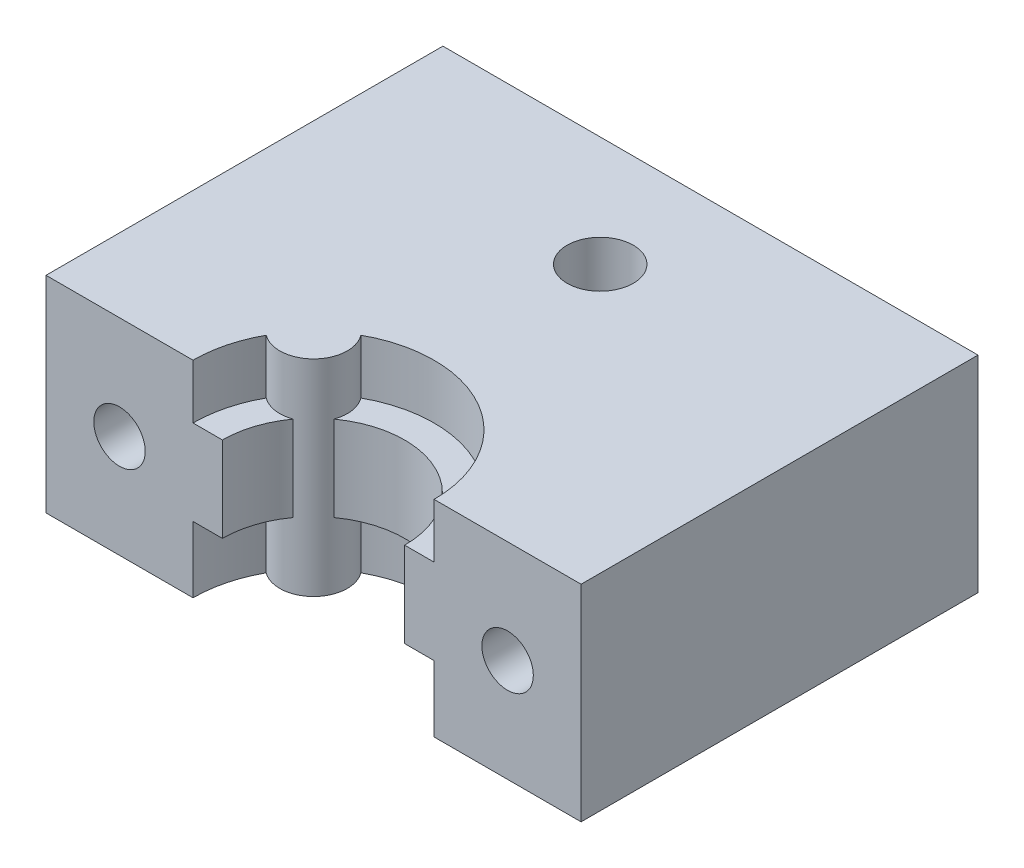
ISO-10303-21;
HEADER;
FILE_DESCRIPTION(('STEP AP214'),'2;1');
FILE_NAME('part.step','',(''),(''),'','','');
FILE_SCHEMA(('AUTOMOTIVE_DESIGN { 1 0 10303 214 1 1 1 1 }'));
ENDSEC;
DATA;
#1=APPLICATION_CONTEXT('core data for automotive mechanical design processes');
#2=APPLICATION_PROTOCOL_DEFINITION('international standard','automotive_design',2000,#1);
#3=PRODUCT_CONTEXT('',#1,'mechanical');
#4=PRODUCT('Part','Part','',(#3));
#5=PRODUCT_RELATED_PRODUCT_CATEGORY('part','',(#4));
#6=PRODUCT_DEFINITION_FORMATION('','',#4);
#7=PRODUCT_DEFINITION_CONTEXT('part definition',#1,'design');
#8=PRODUCT_DEFINITION('design','',#6,#7);
#9=PRODUCT_DEFINITION_SHAPE('','',#8);
#10=(LENGTH_UNIT() NAMED_UNIT(*) SI_UNIT(.MILLI.,.METRE.));
#11=(NAMED_UNIT(*) PLANE_ANGLE_UNIT() SI_UNIT($,.RADIAN.));
#12=(NAMED_UNIT(*) SI_UNIT($,.STERADIAN.) SOLID_ANGLE_UNIT());
#13=UNCERTAINTY_MEASURE_WITH_UNIT(LENGTH_MEASURE(1.E-05),#10,'distance_accuracy_value','');
#14=(GEOMETRIC_REPRESENTATION_CONTEXT(3) GLOBAL_UNCERTAINTY_ASSIGNED_CONTEXT((#13)) GLOBAL_UNIT_ASSIGNED_CONTEXT((#10,
#11,#12)) REPRESENTATION_CONTEXT('',''));
#15=CARTESIAN_POINT('',(0.,0.,0.));
#16=DIRECTION('',(0.,0.,1.));
#17=DIRECTION('',(1.,0.,0.));
#18=AXIS2_PLACEMENT_3D('',#15,#16,#17);
#19=CARTESIAN_POINT('',(31.4,7.,-31.9497474683059));
#20=DIRECTION('',(0.,0.,1.));
#21=DIRECTION('',(1.,0.,0.));
#22=AXIS2_PLACEMENT_3D('',#19,#20,#21);
#23=CYLINDRICAL_SURFACE('',#22,1.75000000000001);
#24=CARTESIAN_POINT('',(31.4,7.,0.));
#25=DIRECTION('',(0.,0.,1.));
#26=DIRECTION('',(1.,0.,0.));
#27=AXIS2_PLACEMENT_3D('',#24,#25,#26);
#28=CIRCLE('',#27,1.75000000000001);
#29=CARTESIAN_POINT('',(33.15,7.,0.));
#30=VERTEX_POINT('',#29);
#31=EDGE_CURVE('E279',#30,#30,#28,.T.);
#32=ORIENTED_EDGE('',*,*,#31,.T.);
#33=EDGE_LOOP('',(#32));
#34=FACE_BOUND('',#33,.T.);
#35=CARTESIAN_POINT('',(31.4,7.,-22.));
#36=DIRECTION('',(0.,0.,-1.));
#37=DIRECTION('',(-1.,0.,0.));
#38=AXIS2_PLACEMENT_3D('',#35,#36,#37);
#39=CIRCLE('',#38,1.75000000000001);
#40=CARTESIAN_POINT('',(29.65,7.,-22.));
#41=VERTEX_POINT('',#40);
#42=EDGE_CURVE('E43',#41,#41,#39,.F.);
#43=ORIENTED_EDGE('',*,*,#42,.F.);
#44=EDGE_LOOP('',(#43));
#45=FACE_BOUND('',#44,.T.);
#46=ADVANCED_FACE('F39',(#34,#45),#23,.F.);
#47=CARTESIAN_POINT('',(5.,7.,-31.9497474683059));
#48=DIRECTION('',(0.,0.,1.));
#49=DIRECTION('',(1.,0.,0.));
#50=AXIS2_PLACEMENT_3D('',#47,#48,#49);
#51=CYLINDRICAL_SURFACE('',#50,1.75);
#52=CARTESIAN_POINT('',(5.,7.,0.));
#53=DIRECTION('',(0.,0.,1.));
#54=DIRECTION('',(1.,0.,0.));
#55=AXIS2_PLACEMENT_3D('',#52,#53,#54);
#56=CIRCLE('',#55,1.75);
#57=CARTESIAN_POINT('',(6.75,7.,0.));
#58=VERTEX_POINT('',#57);
#59=EDGE_CURVE('E298',#58,#58,#56,.T.);
#60=ORIENTED_EDGE('',*,*,#59,.T.);
#61=EDGE_LOOP('',(#60));
#62=FACE_BOUND('',#61,.T.);
#63=CARTESIAN_POINT('',(5.,7.,-22.));
#64=DIRECTION('',(0.,0.,-1.));
#65=DIRECTION('',(-1.,0.,0.));
#66=AXIS2_PLACEMENT_3D('',#63,#64,#65);
#67=CIRCLE('',#66,1.75);
#68=CARTESIAN_POINT('',(3.25,7.,-22.));
#69=VERTEX_POINT('',#68);
#70=EDGE_CURVE('E273',#69,#69,#67,.F.);
#71=ORIENTED_EDGE('',*,*,#70,.F.);
#72=EDGE_LOOP('',(#71));
#73=FACE_BOUND('',#72,.T.);
#74=ADVANCED_FACE('F322',(#62,#73),#51,.F.);
#75=CARTESIAN_POINT('',(18.2,-18.3357574154983,0.));
#76=DIRECTION('',(0.,1.,0.));
#77=DIRECTION('',(-1.,0.,0.));
#78=AXIS2_PLACEMENT_3D('',#75,#76,#77);
#79=CYLINDRICAL_SURFACE('',#78,8.2);
#80=DIRECTION('',(0.,1.,0.));
#81=VECTOR('',#80,1.);
#82=CARTESIAN_POINT('',(14.2400818494279,-18.3357574154983,-7.18046295448765));
#83=LINE('',#82,#81);
#84=CARTESIAN_POINT('',(14.2400818494279,10.3,-7.18046295448765));
#85=VERTEX_POINT('',#84);
#86=CARTESIAN_POINT('',(14.2400818494279,14.,-7.18046295448765));
#87=VERTEX_POINT('',#86);
#88=EDGE_CURVE('E214',#85,#87,#83,.T.);
#89=ORIENTED_EDGE('',*,*,#88,.F.);
#90=CARTESIAN_POINT('',(18.2,10.3,0.));
#91=DIRECTION('',(0.,1.,0.));
#92=DIRECTION('',(1.,0.,0.));
#93=AXIS2_PLACEMENT_3D('',#90,#91,#92);
#94=CIRCLE('',#93,8.2);
#95=CARTESIAN_POINT('',(26.4,10.3,0.));
#96=VERTEX_POINT('',#95);
#97=EDGE_CURVE('E190',#96,#85,#94,.T.);
#98=ORIENTED_EDGE('',*,*,#97,.F.);
#99=DIRECTION('',(0.,1.,0.));
#100=VECTOR('',#99,1.);
#101=CARTESIAN_POINT('',(26.4,-18.3357574154983,0.));
#102=LINE('',#101,#100);
#103=CARTESIAN_POINT('',(26.4,14.,0.));
#104=VERTEX_POINT('',#103);
#105=EDGE_CURVE('E204',#96,#104,#102,.T.);
#106=ORIENTED_EDGE('',*,*,#105,.T.);
#107=CARTESIAN_POINT('',(18.2,14.,0.));
#108=DIRECTION('',(0.,1.,0.));
#109=DIRECTION('',(-1.,0.,0.));
#110=AXIS2_PLACEMENT_3D('',#107,#108,#109);
#111=CIRCLE('',#110,8.2);
#112=EDGE_CURVE('E201',#87,#104,#111,.F.);
#113=ORIENTED_EDGE('',*,*,#112,.F.);
#114=EDGE_LOOP('',(#89,#98,#106,#113));
#115=FACE_BOUND('',#114,.T.);
#116=ADVANCED_FACE('F315',(#115),#79,.F.);
#117=CARTESIAN_POINT('',(18.2,-18.3357574154983,0.));
#118=DIRECTION('',(0.,1.,0.));
#119=DIRECTION('',(-1.,0.,0.));
#120=AXIS2_PLACEMENT_3D('',#117,#118,#119);
#121=CYLINDRICAL_SURFACE('',#120,8.2);
#122=DIRECTION('',(0.,1.,0.));
#123=VECTOR('',#122,1.);
#124=CARTESIAN_POINT('',(10.,-18.3357574154983,0.));
#125=LINE('',#124,#123);
#126=CARTESIAN_POINT('',(9.99999999999999,10.3,0.));
#127=VERTEX_POINT('',#126);
#128=CARTESIAN_POINT('',(9.99999999999999,14.,0.));
#129=VERTEX_POINT('',#128);
#130=EDGE_CURVE('E228',#127,#129,#125,.T.);
#131=ORIENTED_EDGE('',*,*,#130,.F.);
#132=CARTESIAN_POINT('',(18.2,10.3,0.));
#133=DIRECTION('',(0.,-1.,0.));
#134=DIRECTION('',(1.,0.,0.));
#135=AXIS2_PLACEMENT_3D('',#132,#133,#134);
#136=CIRCLE('',#135,8.2);
#137=CARTESIAN_POINT('',(11.0195370455124,10.3,-3.95991815057212));
#138=VERTEX_POINT('',#137);
#139=EDGE_CURVE('E263',#127,#138,#136,.T.);
#140=ORIENTED_EDGE('',*,*,#139,.T.);
#141=DIRECTION('',(0.,1.,0.));
#142=VECTOR('',#141,1.);
#143=CARTESIAN_POINT('',(11.0195370455124,-18.3357574154983,-3.95991815057212));
#144=LINE('',#143,#142);
#145=CARTESIAN_POINT('',(11.0195370455124,14.,-3.95991815057212));
#146=VERTEX_POINT('',#145);
#147=EDGE_CURVE('E233',#138,#146,#144,.T.);
#148=ORIENTED_EDGE('',*,*,#147,.T.);
#149=CARTESIAN_POINT('',(18.2,14.,0.));
#150=DIRECTION('',(0.,1.,0.));
#151=DIRECTION('',(-1.,0.,0.));
#152=AXIS2_PLACEMENT_3D('',#149,#150,#151);
#153=CIRCLE('',#152,8.2);
#154=EDGE_CURVE('E206',#129,#146,#153,.F.);
#155=ORIENTED_EDGE('',*,*,#154,.F.);
#156=EDGE_LOOP('',(#131,#140,#148,#155));
#157=FACE_BOUND('',#156,.T.);
#158=ADVANCED_FACE('F307',(#157),#121,.F.);
#159=CARTESIAN_POINT('',(0.,0.,0.));
#160=DIRECTION('',(0.,0.,-1.));
#161=DIRECTION('',(-1.,0.,0.));
#162=AXIS2_PLACEMENT_3D('',#159,#160,#161);
#163=PLANE('',#162);
#164=ORIENTED_EDGE('',*,*,#31,.F.);
#165=EDGE_LOOP('',(#164));
#166=FACE_BOUND('',#165,.T.);
#167=CARTESIAN_POINT('',(26.4,0.,0.));
#168=VERTEX_POINT('',#167);
#169=CARTESIAN_POINT('',(26.4,4.50000000000001,0.));
#170=VERTEX_POINT('',#169);
#171=EDGE_CURVE('E226',#168,#170,#102,.T.);
#172=ORIENTED_EDGE('',*,*,#171,.F.);
#173=DIRECTION('',(1.,0.,0.));
#174=VECTOR('',#173,1.);
#175=CARTESIAN_POINT('',(0.,0.,0.));
#176=LINE('',#175,#174);
#177=CARTESIAN_POINT('',(36.4,0.,0.));
#178=VERTEX_POINT('',#177);
#179=EDGE_CURVE('E250',#168,#178,#176,.T.);
#180=ORIENTED_EDGE('',*,*,#179,.T.);
#181=DIRECTION('',(0.,1.,0.));
#182=VECTOR('',#181,1.);
#183=CARTESIAN_POINT('',(36.4,0.,0.));
#184=LINE('',#183,#182);
#185=CARTESIAN_POINT('',(36.4,14.,0.));
#186=VERTEX_POINT('',#185);
#187=EDGE_CURVE('E254',#178,#186,#184,.T.);
#188=ORIENTED_EDGE('',*,*,#187,.T.);
#189=DIRECTION('',(-1.,0.,0.));
#190=VECTOR('',#189,1.);
#191=CARTESIAN_POINT('',(0.,14.,0.));
#192=LINE('',#191,#190);
#193=EDGE_CURVE('E238',#186,#104,#192,.T.);
#194=ORIENTED_EDGE('',*,*,#193,.T.);
#195=ORIENTED_EDGE('',*,*,#105,.F.);
#196=DIRECTION('',(1.,0.,0.));
#197=VECTOR('',#196,1.);
#198=CARTESIAN_POINT('',(24.4,10.3,0.));
#199=LINE('',#198,#197);
#200=CARTESIAN_POINT('',(24.4,10.3,0.));
#201=VERTEX_POINT('',#200);
#202=EDGE_CURVE('E56',#201,#96,#199,.T.);
#203=ORIENTED_EDGE('',*,*,#202,.F.);
#204=DIRECTION('',(0.,1.,0.));
#205=VECTOR('',#204,1.);
#206=CARTESIAN_POINT('',(24.4,4.5,0.));
#207=LINE('',#206,#205);
#208=CARTESIAN_POINT('',(24.4,4.5,0.));
#209=VERTEX_POINT('',#208);
#210=EDGE_CURVE('E158',#209,#201,#207,.T.);
#211=ORIENTED_EDGE('',*,*,#210,.F.);
#212=DIRECTION('',(1.,0.,0.));
#213=VECTOR('',#212,1.);
#214=CARTESIAN_POINT('',(24.4,4.5,0.));
#215=LINE('',#214,#213);
#216=EDGE_CURVE('E170',#209,#170,#215,.T.);
#217=ORIENTED_EDGE('',*,*,#216,.T.);
#218=EDGE_LOOP('',(#172,#180,#188,#194,#195,#203,#211,#217));
#219=FACE_BOUND('',#218,.T.);
#220=ADVANCED_FACE('F169',(#166,#219),#163,.F.);
#221=ORIENTED_EDGE('',*,*,#59,.F.);
#222=EDGE_LOOP('',(#221));
#223=FACE_BOUND('',#222,.T.);
#224=CARTESIAN_POINT('',(10.,0.,0.));
#225=VERTEX_POINT('',#224);
#226=CARTESIAN_POINT('',(9.99999999999999,4.5,0.));
#227=VERTEX_POINT('',#226);
#228=EDGE_CURVE('E210',#225,#227,#125,.T.);
#229=ORIENTED_EDGE('',*,*,#228,.T.);
#230=DIRECTION('',(1.,0.,0.));
#231=VECTOR('',#230,1.);
#232=CARTESIAN_POINT('',(12.,4.5,0.));
#233=LINE('',#232,#231);
#234=CARTESIAN_POINT('',(12.,4.5,0.));
#235=VERTEX_POINT('',#234);
#236=EDGE_CURVE('E174',#227,#235,#233,.T.);
#237=ORIENTED_EDGE('',*,*,#236,.T.);
#238=DIRECTION('',(0.,1.,0.));
#239=VECTOR('',#238,1.);
#240=CARTESIAN_POINT('',(12.,4.5,0.));
#241=LINE('',#240,#239);
#242=CARTESIAN_POINT('',(12.,10.3,0.));
#243=VERTEX_POINT('',#242);
#244=EDGE_CURVE('E173',#235,#243,#241,.T.);
#245=ORIENTED_EDGE('',*,*,#244,.T.);
#246=DIRECTION('',(1.,0.,0.));
#247=VECTOR('',#246,1.);
#248=CARTESIAN_POINT('',(12.,10.3,0.));
#249=LINE('',#248,#247);
#250=EDGE_CURVE('E164',#127,#243,#249,.T.);
#251=ORIENTED_EDGE('',*,*,#250,.F.);
#252=ORIENTED_EDGE('',*,*,#130,.T.);
#253=CARTESIAN_POINT('',(0.,14.,0.));
#254=VERTEX_POINT('',#253);
#255=EDGE_CURVE('E257',#129,#254,#192,.T.);
#256=ORIENTED_EDGE('',*,*,#255,.T.);
#257=DIRECTION('',(0.,-1.,0.));
#258=VECTOR('',#257,1.);
#259=CARTESIAN_POINT('',(0.,0.,0.));
#260=LINE('',#259,#258);
#261=CARTESIAN_POINT('',(0.,0.,0.));
#262=VERTEX_POINT('',#261);
#263=EDGE_CURVE('E218',#254,#262,#260,.T.);
#264=ORIENTED_EDGE('',*,*,#263,.T.);
#265=EDGE_CURVE('E251',#262,#225,#176,.T.);
#266=ORIENTED_EDGE('',*,*,#265,.T.);
#267=EDGE_LOOP('',(#229,#237,#245,#251,#252,#256,#264,#266));
#268=FACE_BOUND('',#267,.T.);
#269=ADVANCED_FACE('F306',(#223,#268),#163,.F.);
#270=CARTESIAN_POINT('',(0.,0.,-27.));
#271=DIRECTION('',(-1.,0.,0.));
#272=DIRECTION('',(0.,0.,1.));
#273=AXIS2_PLACEMENT_3D('',#270,#271,#272);
#274=PLANE('',#273);
#275=ORIENTED_EDGE('',*,*,#263,.F.);
#276=DIRECTION('',(0.,0.,1.));
#277=VECTOR('',#276,1.);
#278=CARTESIAN_POINT('',(0.,14.,-27.));
#279=LINE('',#278,#277);
#280=CARTESIAN_POINT('',(0.,14.,-27.));
#281=VERTEX_POINT('',#280);
#282=EDGE_CURVE('E260',#281,#254,#279,.T.);
#283=ORIENTED_EDGE('',*,*,#282,.F.);
#284=DIRECTION('',(0.,-1.,0.));
#285=VECTOR('',#284,1.);
#286=CARTESIAN_POINT('',(0.,0.,-27.));
#287=LINE('',#286,#285);
#288=CARTESIAN_POINT('',(0.,0.,-27.));
#289=VERTEX_POINT('',#288);
#290=EDGE_CURVE('E234',#281,#289,#287,.T.);
#291=ORIENTED_EDGE('',*,*,#290,.T.);
#292=DIRECTION('',(0.,0.,1.));
#293=VECTOR('',#292,1.);
#294=CARTESIAN_POINT('',(0.,0.,-27.));
#295=LINE('',#294,#293);
#296=EDGE_CURVE('E247',#289,#262,#295,.T.);
#297=ORIENTED_EDGE('',*,*,#296,.T.);
#298=EDGE_LOOP('',(#275,#283,#291,#297));
#299=FACE_BOUND('',#298,.T.);
#300=ADVANCED_FACE('F41',(#299),#274,.T.);
#301=CARTESIAN_POINT('',(0.,14.,-27.));
#302=DIRECTION('',(0.,1.,0.));
#303=DIRECTION('',(-1.,0.,0.));
#304=AXIS2_PLACEMENT_3D('',#301,#302,#303);
#305=PLANE('',#304);
#306=CARTESIAN_POINT('',(18.2,14.,-19.5));
#307=DIRECTION('',(0.,1.,0.));
#308=DIRECTION('',(-1.,0.,0.));
#309=AXIS2_PLACEMENT_3D('',#306,#307,#308);
#310=CIRCLE('',#309,2.25);
#311=CARTESIAN_POINT('',(15.95,14.,-19.5));
#312=VERTEX_POINT('',#311);
#313=EDGE_CURVE('E289',#312,#312,#310,.T.);
#314=ORIENTED_EDGE('',*,*,#313,.F.);
#315=EDGE_LOOP('',(#314));
#316=FACE_BOUND('',#315,.T.);
#317=CARTESIAN_POINT('',(12.4017243942703,14.,-5.79827560572969));
#318=DIRECTION('',(0.,1.,0.));
#319=DIRECTION('',(-1.,0.,0.));
#320=AXIS2_PLACEMENT_3D('',#317,#318,#319);
#321=CIRCLE('',#320,2.3);
#322=EDGE_CURVE('E211',#146,#87,#321,.T.);
#323=ORIENTED_EDGE('',*,*,#322,.T.);
#324=ORIENTED_EDGE('',*,*,#112,.T.);
#325=ORIENTED_EDGE('',*,*,#193,.F.);
#326=DIRECTION('',(0.,0.,1.));
#327=VECTOR('',#326,1.);
#328=CARTESIAN_POINT('',(36.4,14.,-27.));
#329=LINE('',#328,#327);
#330=CARTESIAN_POINT('',(36.4,14.,-27.));
#331=VERTEX_POINT('',#330);
#332=EDGE_CURVE('E264',#331,#186,#329,.T.);
#333=ORIENTED_EDGE('',*,*,#332,.F.);
#334=DIRECTION('',(-1.,0.,0.));
#335=VECTOR('',#334,1.);
#336=CARTESIAN_POINT('',(0.,14.,-27.));
#337=LINE('',#336,#335);
#338=EDGE_CURVE('E244',#331,#281,#337,.T.);
#339=ORIENTED_EDGE('',*,*,#338,.T.);
#340=ORIENTED_EDGE('',*,*,#282,.T.);
#341=ORIENTED_EDGE('',*,*,#255,.F.);
#342=ORIENTED_EDGE('',*,*,#154,.T.);
#343=EDGE_LOOP('',(#323,#324,#325,#333,#339,#340,#341,#342));
#344=FACE_BOUND('',#343,.T.);
#345=ADVANCED_FACE('F376',(#316,#344),#305,.T.);
#346=CARTESIAN_POINT('',(36.4,0.,-27.));
#347=DIRECTION('',(1.,0.,0.));
#348=DIRECTION('',(0.,0.,-1.));
#349=AXIS2_PLACEMENT_3D('',#346,#347,#348);
#350=PLANE('',#349);
#351=ORIENTED_EDGE('',*,*,#187,.F.);
#352=DIRECTION('',(0.,0.,1.));
#353=VECTOR('',#352,1.);
#354=CARTESIAN_POINT('',(36.4,0.,-27.));
#355=LINE('',#354,#353);
#356=CARTESIAN_POINT('',(36.4,0.,-27.));
#357=VERTEX_POINT('',#356);
#358=EDGE_CURVE('E266',#357,#178,#355,.T.);
#359=ORIENTED_EDGE('',*,*,#358,.F.);
#360=DIRECTION('',(0.,1.,0.));
#361=VECTOR('',#360,1.);
#362=CARTESIAN_POINT('',(36.4,0.,-27.));
#363=LINE('',#362,#361);
#364=EDGE_CURVE('E241',#357,#331,#363,.T.);
#365=ORIENTED_EDGE('',*,*,#364,.T.);
#366=ORIENTED_EDGE('',*,*,#332,.T.);
#367=EDGE_LOOP('',(#351,#359,#365,#366));
#368=FACE_BOUND('',#367,.T.);
#369=ADVANCED_FACE('F360',(#368),#350,.T.);
#370=CARTESIAN_POINT('',(0.,0.,-27.));
#371=DIRECTION('',(0.,-1.,0.));
#372=DIRECTION('',(1.,0.,0.));
#373=AXIS2_PLACEMENT_3D('',#370,#371,#372);
#374=PLANE('',#373);
#375=ORIENTED_EDGE('',*,*,#179,.F.);
#376=CARTESIAN_POINT('',(18.2,0.,0.));
#377=DIRECTION('',(0.,-1.,0.));
#378=DIRECTION('',(1.,0.,0.));
#379=AXIS2_PLACEMENT_3D('',#376,#377,#378);
#380=CIRCLE('',#379,8.2);
#381=CARTESIAN_POINT('',(14.2400818494279,0.,-7.18046295448765));
#382=VERTEX_POINT('',#381);
#383=EDGE_CURVE('E216',#382,#168,#380,.T.);
#384=ORIENTED_EDGE('',*,*,#383,.F.);
#385=CARTESIAN_POINT('',(12.4017243942703,0.,-5.79827560572969));
#386=DIRECTION('',(0.,-1.,0.));
#387=DIRECTION('',(1.,0.,0.));
#388=AXIS2_PLACEMENT_3D('',#385,#386,#387);
#389=CIRCLE('',#388,2.3);
#390=CARTESIAN_POINT('',(11.0195370455124,0.,-3.95991815057212));
#391=VERTEX_POINT('',#390);
#392=EDGE_CURVE('E219',#391,#382,#389,.F.);
#393=ORIENTED_EDGE('',*,*,#392,.F.);
#394=CARTESIAN_POINT('',(18.2,0.,0.));
#395=DIRECTION('',(0.,-1.,0.));
#396=DIRECTION('',(1.,0.,0.));
#397=AXIS2_PLACEMENT_3D('',#394,#395,#396);
#398=CIRCLE('',#397,8.2);
#399=EDGE_CURVE('E209',#225,#391,#398,.T.);
#400=ORIENTED_EDGE('',*,*,#399,.F.);
#401=ORIENTED_EDGE('',*,*,#265,.F.);
#402=ORIENTED_EDGE('',*,*,#296,.F.);
#403=DIRECTION('',(1.,0.,0.));
#404=VECTOR('',#403,1.);
#405=CARTESIAN_POINT('',(0.,0.,-27.));
#406=LINE('',#405,#404);
#407=EDGE_CURVE('E237',#289,#357,#406,.T.);
#408=ORIENTED_EDGE('',*,*,#407,.T.);
#409=ORIENTED_EDGE('',*,*,#358,.T.);
#410=EDGE_LOOP('',(#375,#384,#393,#400,#401,#402,#408,#409));
#411=FACE_BOUND('',#410,.T.);
#412=ADVANCED_FACE('F353',(#411),#374,.T.);
#413=CARTESIAN_POINT('',(0.,0.,-27.));
#414=DIRECTION('',(0.,0.,-1.));
#415=DIRECTION('',(-1.,0.,0.));
#416=AXIS2_PLACEMENT_3D('',#413,#414,#415);
#417=PLANE('',#416);
#418=CARTESIAN_POINT('',(24.,8.,-27.));
#419=DIRECTION('',(0.,0.,-1.));
#420=DIRECTION('',(-1.,0.,0.));
#421=AXIS2_PLACEMENT_3D('',#418,#419,#420);
#422=CIRCLE('',#421,2.25);
#423=CARTESIAN_POINT('',(21.75,8.,-27.));
#424=VERTEX_POINT('',#423);
#425=EDGE_CURVE('E365',#424,#424,#422,.T.);
#426=ORIENTED_EDGE('',*,*,#425,.F.);
#427=EDGE_LOOP('',(#426));
#428=FACE_BOUND('',#427,.T.);
#429=CARTESIAN_POINT('',(31.4,7.,-27.));
#430=DIRECTION('',(0.,0.,-1.));
#431=DIRECTION('',(-1.,0.,0.));
#432=AXIS2_PLACEMENT_3D('',#429,#430,#431);
#433=CIRCLE('',#432,3.25);
#434=CARTESIAN_POINT('',(28.15,7.,-27.));
#435=VERTEX_POINT('',#434);
#436=EDGE_CURVE('E281',#435,#435,#433,.T.);
#437=ORIENTED_EDGE('',*,*,#436,.F.);
#438=EDGE_LOOP('',(#437));
#439=FACE_BOUND('',#438,.T.);
#440=CARTESIAN_POINT('',(5.,7.,-27.));
#441=DIRECTION('',(0.,0.,-1.));
#442=DIRECTION('',(-1.,0.,0.));
#443=AXIS2_PLACEMENT_3D('',#440,#441,#442);
#444=CIRCLE('',#443,3.25);
#445=CARTESIAN_POINT('',(1.75,7.,-27.));
#446=VERTEX_POINT('',#445);
#447=EDGE_CURVE('E286',#446,#446,#444,.T.);
#448=ORIENTED_EDGE('',*,*,#447,.F.);
#449=EDGE_LOOP('',(#448));
#450=FACE_BOUND('',#449,.T.);
#451=ORIENTED_EDGE('',*,*,#290,.F.);
#452=ORIENTED_EDGE('',*,*,#338,.F.);
#453=ORIENTED_EDGE('',*,*,#364,.F.);
#454=ORIENTED_EDGE('',*,*,#407,.F.);
#455=EDGE_LOOP('',(#451,#452,#453,#454));
#456=FACE_BOUND('',#455,.T.);
#457=ADVANCED_FACE('F350',(#428,#439,#450,#456),#417,.T.);
#458=CARTESIAN_POINT('',(12.4017243942703,-18.3357574154983,-5.79827560572969));
#459=DIRECTION('',(0.,1.,0.));
#460=DIRECTION('',(-1.,0.,0.));
#461=AXIS2_PLACEMENT_3D('',#458,#459,#460);
#462=CYLINDRICAL_SURFACE('',#461,2.3);
#463=CARTESIAN_POINT('',(12.4017243942703,4.5,-5.79827560572969));
#464=DIRECTION('',(0.,-1.,0.));
#465=DIRECTION('',(1.,0.,0.));
#466=AXIS2_PLACEMENT_3D('',#463,#464,#465);
#467=CIRCLE('',#466,2.3);
#468=CARTESIAN_POINT('',(11.0195370455124,4.5,-3.95991815057212));
#469=VERTEX_POINT('',#468);
#470=CARTESIAN_POINT('',(13.175433423563,4.5,-3.63231754104079));
#471=VERTEX_POINT('',#470);
#472=EDGE_CURVE('E200',#469,#471,#467,.F.);
#473=ORIENTED_EDGE('',*,*,#472,.F.);
#474=EDGE_CURVE('E215',#391,#469,#144,.T.);
#475=ORIENTED_EDGE('',*,*,#474,.F.);
#476=ORIENTED_EDGE('',*,*,#392,.T.);
#477=CARTESIAN_POINT('',(14.2400818494279,4.5,-7.18046295448765));
#478=VERTEX_POINT('',#477);
#479=EDGE_CURVE('E205',#382,#478,#83,.T.);
#480=ORIENTED_EDGE('',*,*,#479,.T.);
#481=CARTESIAN_POINT('',(14.5676824589592,4.5,-5.02456657643696));
#482=VERTEX_POINT('',#481);
#483=EDGE_CURVE('E198',#482,#478,#467,.F.);
#484=ORIENTED_EDGE('',*,*,#483,.F.);
#485=DIRECTION('',(0.,1.,0.));
#486=VECTOR('',#485,1.);
#487=CARTESIAN_POINT('',(14.5676824589592,7.4,-5.02456657643696));
#488=LINE('',#487,#486);
#489=CARTESIAN_POINT('',(14.5676824589592,10.3,-5.02456657643696));
#490=VERTEX_POINT('',#489);
#491=EDGE_CURVE('E48',#490,#482,#488,.F.);
#492=ORIENTED_EDGE('',*,*,#491,.F.);
#493=CARTESIAN_POINT('',(12.4017243942703,10.3,-5.79827560572969));
#494=DIRECTION('',(0.,-1.,0.));
#495=DIRECTION('',(1.,0.,0.));
#496=AXIS2_PLACEMENT_3D('',#493,#494,#495);
#497=CIRCLE('',#496,2.3);
#498=EDGE_CURVE('E194',#490,#85,#497,.F.);
#499=ORIENTED_EDGE('',*,*,#498,.T.);
#500=ORIENTED_EDGE('',*,*,#88,.T.);
#501=ORIENTED_EDGE('',*,*,#322,.F.);
#502=ORIENTED_EDGE('',*,*,#147,.F.);
#503=CARTESIAN_POINT('',(13.175433423563,10.3,-3.63231754104079));
#504=VERTEX_POINT('',#503);
#505=EDGE_CURVE('E64',#138,#504,#497,.F.);
#506=ORIENTED_EDGE('',*,*,#505,.T.);
#507=DIRECTION('',(0.,1.,0.));
#508=VECTOR('',#507,1.);
#509=CARTESIAN_POINT('',(13.175433423563,7.4,-3.63231754104079));
#510=LINE('',#509,#508);
#511=EDGE_CURVE('E11',#471,#504,#510,.T.);
#512=ORIENTED_EDGE('',*,*,#511,.F.);
#513=EDGE_LOOP('',(#473,#475,#476,#480,#484,#492,#499,#500,#501,#502,#506,#512));
#514=FACE_BOUND('',#513,.T.);
#515=ADVANCED_FACE('F347',(#514),#462,.T.);
#516=CARTESIAN_POINT('',(18.2,4.5,0.));
#517=DIRECTION('',(0.,1.,0.));
#518=DIRECTION('',(1.,0.,0.));
#519=AXIS2_PLACEMENT_3D('',#516,#517,#518);
#520=CIRCLE('',#519,8.2);
#521=EDGE_CURVE('E178',#170,#478,#520,.T.);
#522=ORIENTED_EDGE('',*,*,#521,.T.);
#523=ORIENTED_EDGE('',*,*,#479,.F.);
#524=ORIENTED_EDGE('',*,*,#383,.T.);
#525=ORIENTED_EDGE('',*,*,#171,.T.);
#526=EDGE_LOOP('',(#522,#523,#524,#525));
#527=FACE_BOUND('',#526,.T.);
#528=ADVANCED_FACE('F343',(#527),#79,.F.);
#529=CARTESIAN_POINT('',(18.2,4.5,0.));
#530=DIRECTION('',(0.,-1.,0.));
#531=DIRECTION('',(1.,0.,0.));
#532=AXIS2_PLACEMENT_3D('',#529,#530,#531);
#533=CIRCLE('',#532,8.2);
#534=EDGE_CURVE('E271',#227,#469,#533,.T.);
#535=ORIENTED_EDGE('',*,*,#534,.F.);
#536=ORIENTED_EDGE('',*,*,#228,.F.);
#537=ORIENTED_EDGE('',*,*,#399,.T.);
#538=ORIENTED_EDGE('',*,*,#474,.T.);
#539=EDGE_LOOP('',(#535,#536,#537,#538));
#540=FACE_BOUND('',#539,.T.);
#541=ADVANCED_FACE('F318',(#540),#121,.F.);
#542=CARTESIAN_POINT('',(18.2,4.5,0.));
#543=DIRECTION('',(0.,-1.,0.));
#544=DIRECTION('',(1.,0.,0.));
#545=AXIS2_PLACEMENT_3D('',#542,#543,#544);
#546=PLANE('',#545);
#547=ORIENTED_EDGE('',*,*,#534,.T.);
#548=ORIENTED_EDGE('',*,*,#472,.T.);
#549=CARTESIAN_POINT('',(18.2,4.5,0.));
#550=DIRECTION('',(0.,-1.,0.));
#551=DIRECTION('',(1.,0.,0.));
#552=AXIS2_PLACEMENT_3D('',#549,#550,#551);
#553=CIRCLE('',#552,6.2);
#554=EDGE_CURVE('E163',#235,#471,#553,.T.);
#555=ORIENTED_EDGE('',*,*,#554,.F.);
#556=ORIENTED_EDGE('',*,*,#236,.F.);
#557=EDGE_LOOP('',(#547,#548,#555,#556));
#558=FACE_BOUND('',#557,.T.);
#559=ADVANCED_FACE('F334',(#558),#546,.T.);
#560=CARTESIAN_POINT('',(18.2,10.3,0.));
#561=DIRECTION('',(0.,-1.,0.));
#562=DIRECTION('',(1.,0.,0.));
#563=AXIS2_PLACEMENT_3D('',#560,#561,#562);
#564=PLANE('',#563);
#565=ORIENTED_EDGE('',*,*,#505,.F.);
#566=ORIENTED_EDGE('',*,*,#139,.F.);
#567=ORIENTED_EDGE('',*,*,#250,.T.);
#568=CARTESIAN_POINT('',(18.2,10.3,0.));
#569=DIRECTION('',(0.,-1.,0.));
#570=DIRECTION('',(1.,0.,0.));
#571=AXIS2_PLACEMENT_3D('',#568,#569,#570);
#572=CIRCLE('',#571,6.2);
#573=EDGE_CURVE('E186',#243,#504,#572,.T.);
#574=ORIENTED_EDGE('',*,*,#573,.T.);
#575=EDGE_LOOP('',(#565,#566,#567,#574));
#576=FACE_BOUND('',#575,.T.);
#577=ADVANCED_FACE('F337',(#576),#564,.F.);
#578=CARTESIAN_POINT('',(18.2,4.5,0.));
#579=DIRECTION('',(0.,1.,0.));
#580=DIRECTION('',(-1.,0.,0.));
#581=AXIS2_PLACEMENT_3D('',#578,#579,#580);
#582=CYLINDRICAL_SURFACE('',#581,6.2);
#583=ORIENTED_EDGE('',*,*,#554,.T.);
#584=ORIENTED_EDGE('',*,*,#511,.T.);
#585=ORIENTED_EDGE('',*,*,#573,.F.);
#586=ORIENTED_EDGE('',*,*,#244,.F.);
#587=EDGE_LOOP('',(#583,#584,#585,#586));
#588=FACE_BOUND('',#587,.T.);
#589=ADVANCED_FACE('F338',(#588),#582,.F.);
#590=EDGE_CURVE('E188',#490,#201,#572,.T.);
#591=ORIENTED_EDGE('',*,*,#590,.F.);
#592=ORIENTED_EDGE('',*,*,#491,.T.);
#593=EDGE_CURVE('E154',#482,#209,#553,.T.);
#594=ORIENTED_EDGE('',*,*,#593,.T.);
#595=ORIENTED_EDGE('',*,*,#210,.T.);
#596=EDGE_LOOP('',(#591,#592,#594,#595));
#597=FACE_BOUND('',#596,.T.);
#598=ADVANCED_FACE('F157',(#597),#582,.F.);
#599=ORIENTED_EDGE('',*,*,#593,.F.);
#600=ORIENTED_EDGE('',*,*,#483,.T.);
#601=ORIENTED_EDGE('',*,*,#521,.F.);
#602=ORIENTED_EDGE('',*,*,#216,.F.);
#603=EDGE_LOOP('',(#599,#600,#601,#602));
#604=FACE_BOUND('',#603,.T.);
#605=ADVANCED_FACE('F176',(#604),#546,.T.);
#606=ORIENTED_EDGE('',*,*,#498,.F.);
#607=ORIENTED_EDGE('',*,*,#590,.T.);
#608=ORIENTED_EDGE('',*,*,#202,.T.);
#609=ORIENTED_EDGE('',*,*,#97,.T.);
#610=EDGE_LOOP('',(#606,#607,#608,#609));
#611=FACE_BOUND('',#610,.T.);
#612=ADVANCED_FACE('F333',(#611),#564,.F.);
#613=CARTESIAN_POINT('',(5.,7.,-22.));
#614=DIRECTION('',(0.,0.,-1.));
#615=DIRECTION('',(-1.,0.,0.));
#616=AXIS2_PLACEMENT_3D('',#613,#614,#615);
#617=PLANE('',#616);
#618=CARTESIAN_POINT('',(5.,7.,-22.));
#619=DIRECTION('',(0.,0.,-1.));
#620=DIRECTION('',(-1.,0.,0.));
#621=AXIS2_PLACEMENT_3D('',#618,#619,#620);
#622=CIRCLE('',#621,3.25);
#623=CARTESIAN_POINT('',(1.75,7.,-22.));
#624=VERTEX_POINT('',#623);
#625=EDGE_CURVE('E294',#624,#624,#622,.T.);
#626=ORIENTED_EDGE('',*,*,#625,.T.);
#627=EDGE_LOOP('',(#626));
#628=FACE_BOUND('',#627,.T.);
#629=ORIENTED_EDGE('',*,*,#70,.T.);
#630=EDGE_LOOP('',(#629));
#631=FACE_BOUND('',#630,.T.);
#632=ADVANCED_FACE('F336',(#628,#631),#617,.T.);
#633=CARTESIAN_POINT('',(5.,7.,-22.));
#634=DIRECTION('',(0.,0.,-1.));
#635=DIRECTION('',(-1.,0.,0.));
#636=AXIS2_PLACEMENT_3D('',#633,#634,#635);
#637=CYLINDRICAL_SURFACE('',#636,3.25);
#638=ORIENTED_EDGE('',*,*,#625,.F.);
#639=EDGE_LOOP('',(#638));
#640=FACE_BOUND('',#639,.T.);
#641=ORIENTED_EDGE('',*,*,#447,.T.);
#642=EDGE_LOOP('',(#641));
#643=FACE_BOUND('',#642,.T.);
#644=ADVANCED_FACE('F510',(#640,#643),#637,.F.);
#645=CARTESIAN_POINT('',(31.4,7.,-22.));
#646=DIRECTION('',(0.,0.,-1.));
#647=DIRECTION('',(-1.,0.,0.));
#648=AXIS2_PLACEMENT_3D('',#645,#646,#647);
#649=PLANE('',#648);
#650=CARTESIAN_POINT('',(31.4,7.,-22.));
#651=DIRECTION('',(0.,0.,-1.));
#652=DIRECTION('',(-1.,0.,0.));
#653=AXIS2_PLACEMENT_3D('',#650,#651,#652);
#654=CIRCLE('',#653,3.25);
#655=CARTESIAN_POINT('',(28.15,7.,-22.));
#656=VERTEX_POINT('',#655);
#657=EDGE_CURVE('E275',#656,#656,#654,.T.);
#658=ORIENTED_EDGE('',*,*,#657,.T.);
#659=EDGE_LOOP('',(#658));
#660=FACE_BOUND('',#659,.T.);
#661=ORIENTED_EDGE('',*,*,#42,.T.);
#662=EDGE_LOOP('',(#661));
#663=FACE_BOUND('',#662,.T.);
#664=ADVANCED_FACE('F508',(#660,#663),#649,.T.);
#665=CARTESIAN_POINT('',(31.4,7.,-22.));
#666=DIRECTION('',(0.,0.,-1.));
#667=DIRECTION('',(-1.,0.,0.));
#668=AXIS2_PLACEMENT_3D('',#665,#666,#667);
#669=CYLINDRICAL_SURFACE('',#668,3.25);
#670=ORIENTED_EDGE('',*,*,#657,.F.);
#671=EDGE_LOOP('',(#670));
#672=FACE_BOUND('',#671,.T.);
#673=ORIENTED_EDGE('',*,*,#436,.T.);
#674=EDGE_LOOP('',(#673));
#675=FACE_BOUND('',#674,.T.);
#676=ADVANCED_FACE('F466',(#672,#675),#669,.F.);
#677=CARTESIAN_POINT('',(18.2,7.,-19.5));
#678=DIRECTION('',(0.,1.,0.));
#679=DIRECTION('',(-1.,0.,0.));
#680=AXIS2_PLACEMENT_3D('',#677,#678,#679);
#681=CYLINDRICAL_SURFACE('',#680,2.25);
#682=CARTESIAN_POINT('',(18.2,7.,-19.5));
#683=DIRECTION('',(0.,1.,0.));
#684=DIRECTION('',(-1.,0.,0.));
#685=AXIS2_PLACEMENT_3D('',#682,#683,#684);
#686=CIRCLE('',#685,2.25);
#687=CARTESIAN_POINT('',(15.95,7.,-19.5));
#688=VERTEX_POINT('',#687);
#689=EDGE_CURVE('E297',#688,#688,#686,.T.);
#690=ORIENTED_EDGE('',*,*,#689,.F.);
#691=EDGE_LOOP('',(#690));
#692=FACE_BOUND('',#691,.T.);
#693=ORIENTED_EDGE('',*,*,#313,.T.);
#694=EDGE_LOOP('',(#693));
#695=FACE_BOUND('',#694,.T.);
#696=ADVANCED_FACE('F470',(#692,#695),#681,.F.);
#697=CARTESIAN_POINT('',(18.2,7.,-19.5));
#698=DIRECTION('',(0.,1.,0.));
#699=DIRECTION('',(-1.,0.,0.));
#700=AXIS2_PLACEMENT_3D('',#697,#698,#699);
#701=PLANE('',#700);
#702=ORIENTED_EDGE('',*,*,#689,.T.);
#703=EDGE_LOOP('',(#702));
#704=FACE_BOUND('',#703,.T.);
#705=ADVANCED_FACE('F473',(#704),#701,.T.);
#706=CARTESIAN_POINT('',(24.,8.,-23.));
#707=DIRECTION('',(0.,0.,-1.));
#708=DIRECTION('',(-1.,0.,0.));
#709=AXIS2_PLACEMENT_3D('',#706,#707,#708);
#710=CYLINDRICAL_SURFACE('',#709,2.25);
#711=CARTESIAN_POINT('',(24.,8.,-23.));
#712=DIRECTION('',(0.,0.,-1.));
#713=DIRECTION('',(-1.,0.,0.));
#714=AXIS2_PLACEMENT_3D('',#711,#712,#713);
#715=CIRCLE('',#714,2.25);
#716=CARTESIAN_POINT('',(21.75,8.,-23.));
#717=VERTEX_POINT('',#716);
#718=EDGE_CURVE('E586',#717,#717,#715,.T.);
#719=ORIENTED_EDGE('',*,*,#718,.F.);
#720=EDGE_LOOP('',(#719));
#721=FACE_BOUND('',#720,.T.);
#722=ORIENTED_EDGE('',*,*,#425,.T.);
#723=EDGE_LOOP('',(#722));
#724=FACE_BOUND('',#723,.T.);
#725=ADVANCED_FACE('F481',(#721,#724),#710,.F.);
#726=CARTESIAN_POINT('',(24.,8.,-23.));
#727=DIRECTION('',(0.,0.,-1.));
#728=DIRECTION('',(-1.,0.,0.));
#729=AXIS2_PLACEMENT_3D('',#726,#727,#728);
#730=PLANE('',#729);
#731=ORIENTED_EDGE('',*,*,#718,.T.);
#732=EDGE_LOOP('',(#731));
#733=FACE_BOUND('',#732,.T.);
#734=ADVANCED_FACE('F493',(#733),#730,.T.);
#735=CLOSED_SHELL('',(#46,#74,#116,#158,#220,#269,#300,#345,#369,#412,#457,#515,#528,#541,#559,
#577,#589,#598,#605,#612,#632,#644,#664,#676,#696,#705,#725,#734));
#736=MANIFOLD_SOLID_BREP('B2',#735);
#737=ADVANCED_BREP_SHAPE_REPRESENTATION('',(#18,#736),#14);
#738=SHAPE_DEFINITION_REPRESENTATION(#9,#737);
ENDSEC;
END-ISO-10303-21;
